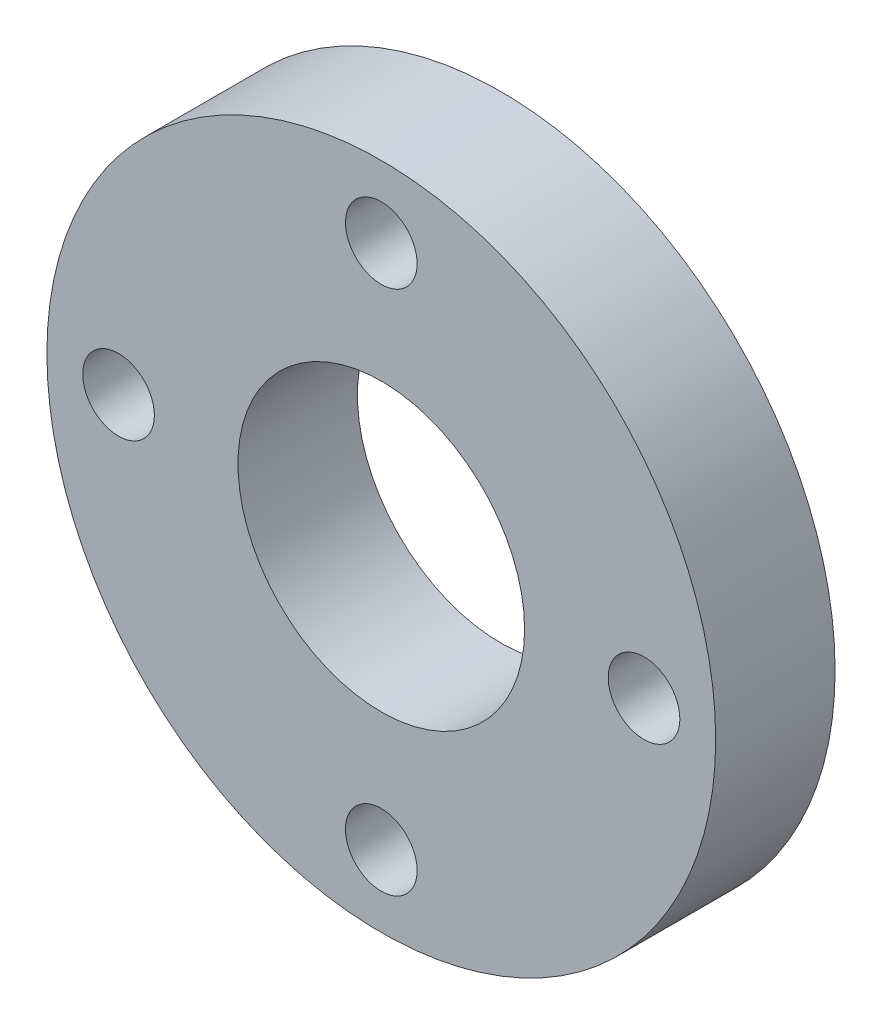
ISO-10303-21;
HEADER;
FILE_DESCRIPTION(('STEP AP214'),'2;1');
FILE_NAME('part.step','',(''),(''),'','','');
FILE_SCHEMA(('AUTOMOTIVE_DESIGN { 1 0 10303 214 1 1 1 1 }'));
ENDSEC;
DATA;
#1=APPLICATION_CONTEXT('core data for automotive mechanical design processes');
#2=APPLICATION_PROTOCOL_DEFINITION('international standard','automotive_design',2000,#1);
#3=PRODUCT_CONTEXT('',#1,'mechanical');
#4=PRODUCT('Part','Part','',(#3));
#5=PRODUCT_RELATED_PRODUCT_CATEGORY('part','',(#4));
#6=PRODUCT_DEFINITION_FORMATION('','',#4);
#7=PRODUCT_DEFINITION_CONTEXT('part definition',#1,'design');
#8=PRODUCT_DEFINITION('design','',#6,#7);
#9=PRODUCT_DEFINITION_SHAPE('','',#8);
#10=(LENGTH_UNIT() NAMED_UNIT(*) SI_UNIT(.MILLI.,.METRE.));
#11=(NAMED_UNIT(*) PLANE_ANGLE_UNIT() SI_UNIT($,.RADIAN.));
#12=(NAMED_UNIT(*) SI_UNIT($,.STERADIAN.) SOLID_ANGLE_UNIT());
#13=UNCERTAINTY_MEASURE_WITH_UNIT(LENGTH_MEASURE(1.E-05),#10,'distance_accuracy_value','');
#14=(GEOMETRIC_REPRESENTATION_CONTEXT(3) GLOBAL_UNCERTAINTY_ASSIGNED_CONTEXT((#13)) GLOBAL_UNIT_ASSIGNED_CONTEXT((#10,
#11,#12)) REPRESENTATION_CONTEXT('',''));
#15=CARTESIAN_POINT('',(0.,0.,0.));
#16=DIRECTION('',(0.,0.,1.));
#17=DIRECTION('',(1.,0.,0.));
#18=AXIS2_PLACEMENT_3D('',#15,#16,#17);
#19=CARTESIAN_POINT('',(0.,0.,5.));
#20=DIRECTION('',(0.,0.,1.));
#21=DIRECTION('',(1.,0.,0.));
#22=AXIS2_PLACEMENT_3D('',#19,#20,#21);
#23=PLANE('',#22);
#24=CARTESIAN_POINT('',(-11.,0.,5.));
#25=DIRECTION('',(0.,0.,1.));
#26=DIRECTION('',(1.,0.,0.));
#27=AXIS2_PLACEMENT_3D('',#24,#25,#26);
#28=CIRCLE('',#27,1.5);
#29=CARTESIAN_POINT('',(-9.5,0.,5.));
#30=VERTEX_POINT('',#29);
#31=EDGE_CURVE('E62',#30,#30,#28,.T.);
#32=ORIENTED_EDGE('',*,*,#31,.F.);
#33=EDGE_LOOP('',(#32));
#34=FACE_BOUND('',#33,.T.);
#35=CARTESIAN_POINT('',(0.,0.,5.));
#36=DIRECTION('',(0.,0.,1.));
#37=DIRECTION('',(1.,0.,0.));
#38=AXIS2_PLACEMENT_3D('',#35,#36,#37);
#39=CIRCLE('',#38,6.);
#40=CARTESIAN_POINT('',(6.,0.,5.));
#41=VERTEX_POINT('',#40);
#42=EDGE_CURVE('E50',#41,#41,#39,.T.);
#43=ORIENTED_EDGE('',*,*,#42,.F.);
#44=EDGE_LOOP('',(#43));
#45=FACE_BOUND('',#44,.T.);
#46=CARTESIAN_POINT('',(0.,0.,5.));
#47=DIRECTION('',(0.,0.,1.));
#48=DIRECTION('',(1.,0.,0.));
#49=AXIS2_PLACEMENT_3D('',#46,#47,#48);
#50=CIRCLE('',#49,14.);
#51=CARTESIAN_POINT('',(14.,0.,5.));
#52=VERTEX_POINT('',#51);
#53=EDGE_CURVE('E10',#52,#52,#50,.T.);
#54=ORIENTED_EDGE('',*,*,#53,.T.);
#55=EDGE_LOOP('',(#54));
#56=FACE_BOUND('',#55,.T.);
#57=CARTESIAN_POINT('',(11.,0.,5.));
#58=DIRECTION('',(0.,0.,1.));
#59=DIRECTION('',(1.,0.,0.));
#60=AXIS2_PLACEMENT_3D('',#57,#58,#59);
#61=CIRCLE('',#60,1.5);
#62=CARTESIAN_POINT('',(12.5,0.,5.));
#63=VERTEX_POINT('',#62);
#64=EDGE_CURVE('E45',#63,#63,#61,.T.);
#65=ORIENTED_EDGE('',*,*,#64,.F.);
#66=EDGE_LOOP('',(#65));
#67=FACE_BOUND('',#66,.T.);
#68=CARTESIAN_POINT('',(0.,-11.,5.));
#69=DIRECTION('',(0.,0.,1.));
#70=DIRECTION('',(1.,0.,0.));
#71=AXIS2_PLACEMENT_3D('',#68,#69,#70);
#72=CIRCLE('',#71,1.5);
#73=CARTESIAN_POINT('',(1.49999999999996,-11.,5.));
#74=VERTEX_POINT('',#73);
#75=EDGE_CURVE('E56',#74,#74,#72,.T.);
#76=ORIENTED_EDGE('',*,*,#75,.F.);
#77=EDGE_LOOP('',(#76));
#78=FACE_BOUND('',#77,.T.);
#79=CARTESIAN_POINT('',(1.15218884181823E-13,11.,5.));
#80=DIRECTION('',(0.,0.,1.));
#81=DIRECTION('',(1.,0.,0.));
#82=AXIS2_PLACEMENT_3D('',#79,#80,#81);
#83=CIRCLE('',#82,1.5);
#84=CARTESIAN_POINT('',(1.50000000000012,11.,5.));
#85=VERTEX_POINT('',#84);
#86=EDGE_CURVE('E68',#85,#85,#83,.T.);
#87=ORIENTED_EDGE('',*,*,#86,.F.);
#88=EDGE_LOOP('',(#87));
#89=FACE_BOUND('',#88,.T.);
#90=ADVANCED_FACE('F34',(#34,#45,#56,#67,#78,#89),#23,.T.);
#91=CARTESIAN_POINT('',(0.,0.,0.));
#92=DIRECTION('',(0.,0.,1.));
#93=DIRECTION('',(1.,0.,0.));
#94=AXIS2_PLACEMENT_3D('',#91,#92,#93);
#95=PLANE('',#94);
#96=CARTESIAN_POINT('',(0.,0.,0.));
#97=DIRECTION('',(0.,0.,1.));
#98=DIRECTION('',(1.,0.,0.));
#99=AXIS2_PLACEMENT_3D('',#96,#97,#98);
#100=CIRCLE('',#99,14.);
#101=CARTESIAN_POINT('',(14.,0.,0.));
#102=VERTEX_POINT('',#101);
#103=EDGE_CURVE('E38',#102,#102,#100,.T.);
#104=ORIENTED_EDGE('',*,*,#103,.F.);
#105=EDGE_LOOP('',(#104));
#106=FACE_BOUND('',#105,.T.);
#107=CARTESIAN_POINT('',(11.,0.,0.));
#108=DIRECTION('',(0.,0.,1.));
#109=DIRECTION('',(1.,0.,0.));
#110=AXIS2_PLACEMENT_3D('',#107,#108,#109);
#111=CIRCLE('',#110,1.5);
#112=CARTESIAN_POINT('',(12.5,0.,0.));
#113=VERTEX_POINT('',#112);
#114=EDGE_CURVE('E47',#113,#113,#111,.T.);
#115=ORIENTED_EDGE('',*,*,#114,.T.);
#116=EDGE_LOOP('',(#115));
#117=FACE_BOUND('',#116,.T.);
#118=CARTESIAN_POINT('',(0.,0.,0.));
#119=DIRECTION('',(0.,0.,1.));
#120=DIRECTION('',(1.,0.,0.));
#121=AXIS2_PLACEMENT_3D('',#118,#119,#120);
#122=CIRCLE('',#121,6.);
#123=CARTESIAN_POINT('',(6.,0.,0.));
#124=VERTEX_POINT('',#123);
#125=EDGE_CURVE('E53',#124,#124,#122,.T.);
#126=ORIENTED_EDGE('',*,*,#125,.T.);
#127=EDGE_LOOP('',(#126));
#128=FACE_BOUND('',#127,.T.);
#129=CARTESIAN_POINT('',(0.,-11.,0.));
#130=DIRECTION('',(0.,0.,1.));
#131=DIRECTION('',(1.,0.,0.));
#132=AXIS2_PLACEMENT_3D('',#129,#130,#131);
#133=CIRCLE('',#132,1.5);
#134=CARTESIAN_POINT('',(1.49999999999996,-11.,0.));
#135=VERTEX_POINT('',#134);
#136=EDGE_CURVE('E59',#135,#135,#133,.T.);
#137=ORIENTED_EDGE('',*,*,#136,.T.);
#138=EDGE_LOOP('',(#137));
#139=FACE_BOUND('',#138,.T.);
#140=CARTESIAN_POINT('',(-11.,0.,0.));
#141=DIRECTION('',(0.,0.,1.));
#142=DIRECTION('',(1.,0.,0.));
#143=AXIS2_PLACEMENT_3D('',#140,#141,#142);
#144=CIRCLE('',#143,1.5);
#145=CARTESIAN_POINT('',(-9.5,0.,0.));
#146=VERTEX_POINT('',#145);
#147=EDGE_CURVE('E65',#146,#146,#144,.T.);
#148=ORIENTED_EDGE('',*,*,#147,.T.);
#149=EDGE_LOOP('',(#148));
#150=FACE_BOUND('',#149,.T.);
#151=CARTESIAN_POINT('',(1.15218884181823E-13,11.,0.));
#152=DIRECTION('',(0.,0.,1.));
#153=DIRECTION('',(1.,0.,0.));
#154=AXIS2_PLACEMENT_3D('',#151,#152,#153);
#155=CIRCLE('',#154,1.5);
#156=CARTESIAN_POINT('',(1.50000000000012,11.,0.));
#157=VERTEX_POINT('',#156);
#158=EDGE_CURVE('E71',#157,#157,#155,.T.);
#159=ORIENTED_EDGE('',*,*,#158,.T.);
#160=EDGE_LOOP('',(#159));
#161=FACE_BOUND('',#160,.T.);
#162=ADVANCED_FACE('F81',(#106,#117,#128,#139,#150,#161),#95,.F.);
#163=CARTESIAN_POINT('',(0.,0.,5.));
#164=DIRECTION('',(0.,0.,-1.));
#165=DIRECTION('',(-1.,0.,0.));
#166=AXIS2_PLACEMENT_3D('',#163,#164,#165);
#167=CYLINDRICAL_SURFACE('',#166,14.);
#168=ORIENTED_EDGE('',*,*,#53,.F.);
#169=EDGE_LOOP('',(#168));
#170=FACE_BOUND('',#169,.T.);
#171=ORIENTED_EDGE('',*,*,#103,.T.);
#172=EDGE_LOOP('',(#171));
#173=FACE_BOUND('',#172,.T.);
#174=ADVANCED_FACE('F36',(#170,#173),#167,.T.);
#175=CARTESIAN_POINT('',(11.,0.,5.));
#176=DIRECTION('',(0.,0.,-1.));
#177=DIRECTION('',(-1.,0.,0.));
#178=AXIS2_PLACEMENT_3D('',#175,#176,#177);
#179=CYLINDRICAL_SURFACE('',#178,1.5);
#180=ORIENTED_EDGE('',*,*,#64,.T.);
#181=EDGE_LOOP('',(#180));
#182=FACE_BOUND('',#181,.T.);
#183=ORIENTED_EDGE('',*,*,#114,.F.);
#184=EDGE_LOOP('',(#183));
#185=FACE_BOUND('',#184,.T.);
#186=ADVANCED_FACE('F91',(#182,#185),#179,.F.);
#187=CARTESIAN_POINT('',(0.,0.,5.));
#188=DIRECTION('',(0.,0.,-1.));
#189=DIRECTION('',(-1.,0.,0.));
#190=AXIS2_PLACEMENT_3D('',#187,#188,#189);
#191=CYLINDRICAL_SURFACE('',#190,6.);
#192=ORIENTED_EDGE('',*,*,#42,.T.);
#193=EDGE_LOOP('',(#192));
#194=FACE_BOUND('',#193,.T.);
#195=ORIENTED_EDGE('',*,*,#125,.F.);
#196=EDGE_LOOP('',(#195));
#197=FACE_BOUND('',#196,.T.);
#198=ADVANCED_FACE('F94',(#194,#197),#191,.F.);
#199=CARTESIAN_POINT('',(0.,-11.,5.));
#200=DIRECTION('',(0.,0.,-1.));
#201=DIRECTION('',(-1.,0.,0.));
#202=AXIS2_PLACEMENT_3D('',#199,#200,#201);
#203=CYLINDRICAL_SURFACE('',#202,1.5);
#204=ORIENTED_EDGE('',*,*,#75,.T.);
#205=EDGE_LOOP('',(#204));
#206=FACE_BOUND('',#205,.T.);
#207=ORIENTED_EDGE('',*,*,#136,.F.);
#208=EDGE_LOOP('',(#207));
#209=FACE_BOUND('',#208,.T.);
#210=ADVANCED_FACE('F98',(#206,#209),#203,.F.);
#211=CARTESIAN_POINT('',(-11.,0.,5.));
#212=DIRECTION('',(0.,0.,-1.));
#213=DIRECTION('',(-1.,0.,0.));
#214=AXIS2_PLACEMENT_3D('',#211,#212,#213);
#215=CYLINDRICAL_SURFACE('',#214,1.5);
#216=ORIENTED_EDGE('',*,*,#31,.T.);
#217=EDGE_LOOP('',(#216));
#218=FACE_BOUND('',#217,.T.);
#219=ORIENTED_EDGE('',*,*,#147,.F.);
#220=EDGE_LOOP('',(#219));
#221=FACE_BOUND('',#220,.T.);
#222=ADVANCED_FACE('F102',(#218,#221),#215,.F.);
#223=CARTESIAN_POINT('',(1.15218884181823E-13,11.,5.));
#224=DIRECTION('',(0.,0.,-1.));
#225=DIRECTION('',(-1.,0.,0.));
#226=AXIS2_PLACEMENT_3D('',#223,#224,#225);
#227=CYLINDRICAL_SURFACE('',#226,1.5);
#228=ORIENTED_EDGE('',*,*,#86,.T.);
#229=EDGE_LOOP('',(#228));
#230=FACE_BOUND('',#229,.T.);
#231=ORIENTED_EDGE('',*,*,#158,.F.);
#232=EDGE_LOOP('',(#231));
#233=FACE_BOUND('',#232,.T.);
#234=ADVANCED_FACE('F77',(#230,#233),#227,.F.);
#235=CLOSED_SHELL('',(#90,#162,#174,#186,#198,#210,#222,#234));
#236=MANIFOLD_SOLID_BREP('B2',#235);
#237=ADVANCED_BREP_SHAPE_REPRESENTATION('',(#18,#236),#14);
#238=SHAPE_DEFINITION_REPRESENTATION(#9,#237);
ENDSEC;
END-ISO-10303-21;
